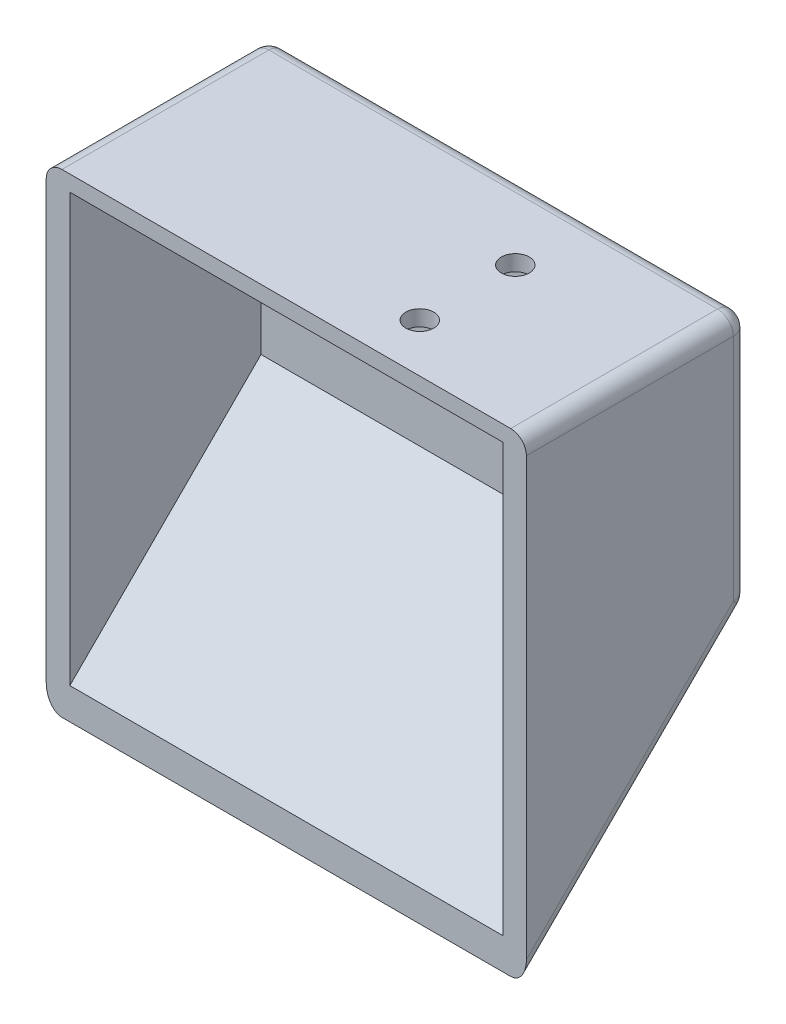
ISO-10303-21;
HEADER;
FILE_DESCRIPTION(('STEP AP214'),'2;1');
FILE_NAME('part.step','',(''),(''),'','','');
FILE_SCHEMA(('AUTOMOTIVE_DESIGN { 1 0 10303 214 1 1 1 1 }'));
ENDSEC;
DATA;
#1=APPLICATION_CONTEXT('core data for automotive mechanical design processes');
#2=APPLICATION_PROTOCOL_DEFINITION('international standard','automotive_design',2000,#1);
#3=PRODUCT_CONTEXT('',#1,'mechanical');
#4=PRODUCT('Part','Part','',(#3));
#5=PRODUCT_RELATED_PRODUCT_CATEGORY('part','',(#4));
#6=PRODUCT_DEFINITION_FORMATION('','',#4);
#7=PRODUCT_DEFINITION_CONTEXT('part definition',#1,'design');
#8=PRODUCT_DEFINITION('design','',#6,#7);
#9=PRODUCT_DEFINITION_SHAPE('','',#8);
#10=(LENGTH_UNIT() NAMED_UNIT(*) SI_UNIT(.MILLI.,.METRE.));
#11=(NAMED_UNIT(*) PLANE_ANGLE_UNIT() SI_UNIT($,.RADIAN.));
#12=(NAMED_UNIT(*) SI_UNIT($,.STERADIAN.) SOLID_ANGLE_UNIT());
#13=UNCERTAINTY_MEASURE_WITH_UNIT(LENGTH_MEASURE(1.E-05),#10,'distance_accuracy_value','');
#14=(GEOMETRIC_REPRESENTATION_CONTEXT(3) GLOBAL_UNCERTAINTY_ASSIGNED_CONTEXT((#13)) GLOBAL_UNIT_ASSIGNED_CONTEXT((#10,
#11,#12)) REPRESENTATION_CONTEXT('',''));
#15=CARTESIAN_POINT('',(0.,0.,0.));
#16=DIRECTION('',(0.,0.,1.));
#17=DIRECTION('',(1.,0.,0.));
#18=AXIS2_PLACEMENT_3D('',#15,#16,#17);
#19=CARTESIAN_POINT('',(18.1327753270791,82.564789442006,48.3517867539628));
#20=DIRECTION('',(0.,-1.,0.));
#21=DIRECTION('',(1.,0.,0.));
#22=AXIS2_PLACEMENT_3D('',#19,#20,#21);
#23=PLANE('',#22);
#24=DIRECTION('',(-1.,0.,0.));
#25=VECTOR('',#24,1.);
#26=CARTESIAN_POINT('',(18.1327753270791,82.564789442006,50.8917867539628));
#27=LINE('',#26,#25);
#28=CARTESIAN_POINT('',(54.3277753270791,82.564789442006,50.8917867539628));
#29=VERTEX_POINT('',#28);
#30=CARTESIAN_POINT('',(-18.0622246729209,82.564789442006,50.8917867539628));
#31=VERTEX_POINT('',#30);
#32=EDGE_CURVE('E55',#29,#31,#27,.T.);
#33=ORIENTED_EDGE('',*,*,#32,.T.);
#34=DIRECTION('',(0.,0.,1.));
#35=VECTOR('',#34,1.);
#36=CARTESIAN_POINT('',(-18.0622246729209,82.564789442006,48.3517867539628));
#37=LINE('',#36,#35);
#38=CARTESIAN_POINT('',(-18.0622246729209,82.564789442006,84.2728112382394));
#39=VERTEX_POINT('',#38);
#40=EDGE_CURVE('E48',#31,#39,#37,.T.);
#41=ORIENTED_EDGE('',*,*,#40,.T.);
#42=DIRECTION('',(1.,0.,0.));
#43=VECTOR('',#42,1.);
#44=CARTESIAN_POINT('',(56.8677753270791,82.564789442006,84.2728112382394));
#45=LINE('',#44,#43);
#46=CARTESIAN_POINT('',(54.3277753270791,82.564789442006,84.2728112382394));
#47=VERTEX_POINT('',#46);
#48=EDGE_CURVE('E165',#39,#47,#45,.T.);
#49=ORIENTED_EDGE('',*,*,#48,.T.);
#50=DIRECTION('',(0.,0.,-1.));
#51=VECTOR('',#50,1.);
#52=CARTESIAN_POINT('',(54.3277753270791,82.564789442006,48.3517867539628));
#53=LINE('',#52,#51);
#54=EDGE_CURVE('E11',#47,#29,#53,.T.);
#55=ORIENTED_EDGE('',*,*,#54,.T.);
#56=EDGE_LOOP('',(#33,#41,#49,#55));
#57=FACE_BOUND('',#56,.T.);
#58=CARTESIAN_POINT('',(31.8547475770863,82.564789442006,61.0517867539628));
#59=DIRECTION('',(0.,-1.,0.));
#60=DIRECTION('',(1.,0.,0.));
#61=AXIS2_PLACEMENT_3D('',#58,#59,#60);
#62=CIRCLE('',#61,2.25);
#63=CARTESIAN_POINT('',(34.1047475770863,82.564789442006,61.0517867539628));
#64=VERTEX_POINT('',#63);
#65=EDGE_CURVE('E43',#64,#64,#62,.F.);
#66=ORIENTED_EDGE('',*,*,#65,.F.);
#67=EDGE_LOOP('',(#66));
#68=FACE_BOUND('',#67,.T.);
#69=CARTESIAN_POINT('',(31.8547475770863,82.564789442006,76.4578204903704));
#70=DIRECTION('',(0.,-1.,0.));
#71=DIRECTION('',(1.,0.,0.));
#72=AXIS2_PLACEMENT_3D('',#69,#70,#71);
#73=CIRCLE('',#72,2.25);
#74=CARTESIAN_POINT('',(34.1047475770863,82.564789442006,76.4578204903704));
#75=VERTEX_POINT('',#74);
#76=EDGE_CURVE('E388',#75,#75,#73,.F.);
#77=ORIENTED_EDGE('',*,*,#76,.F.);
#78=EDGE_LOOP('',(#77));
#79=FACE_BOUND('',#78,.T.);
#80=ADVANCED_FACE('F39',(#57,#68,#79),#23,.F.);
#81=CARTESIAN_POINT('',(18.1327753270791,60.974789442006,53.4317867539628));
#82=DIRECTION('',(0.,0.,1.));
#83=DIRECTION('',(1.,0.,0.));
#84=AXIS2_PLACEMENT_3D('',#81,#82,#83);
#85=PLANE('',#84);
#86=DIRECTION('',(0.,-1.,0.));
#87=VECTOR('',#86,1.);
#88=CARTESIAN_POINT('',(-16.7922246729209,41.924789442006,53.4317867539628));
#89=LINE('',#88,#87);
#90=CARTESIAN_POINT('',(-16.7922246729209,80.024789442006,53.4317867539628));
#91=VERTEX_POINT('',#90);
#92=CARTESIAN_POINT('',(-16.7922246729209,41.924789442006,53.4317867539628));
#93=VERTEX_POINT('',#92);
#94=EDGE_CURVE('E182',#91,#93,#89,.T.);
#95=ORIENTED_EDGE('',*,*,#94,.T.);
#96=DIRECTION('',(1.,0.,0.));
#97=VECTOR('',#96,1.);
#98=CARTESIAN_POINT('',(53.0577753270791,41.924789442006,53.4317867539628));
#99=LINE('',#98,#97);
#100=CARTESIAN_POINT('',(53.0577753270791,41.924789442006,53.4317867539628));
#101=VERTEX_POINT('',#100);
#102=EDGE_CURVE('E191',#93,#101,#99,.T.);
#103=ORIENTED_EDGE('',*,*,#102,.T.);
#104=DIRECTION('',(0.,1.,0.));
#105=VECTOR('',#104,1.);
#106=CARTESIAN_POINT('',(53.0577753270791,41.924789442006,53.4317867539628));
#107=LINE('',#106,#105);
#108=CARTESIAN_POINT('',(53.0577753270791,80.024789442006,53.4317867539628));
#109=VERTEX_POINT('',#108);
#110=EDGE_CURVE('E193',#101,#109,#107,.T.);
#111=ORIENTED_EDGE('',*,*,#110,.T.);
#112=DIRECTION('',(-1.,0.,0.));
#113=VECTOR('',#112,1.);
#114=CARTESIAN_POINT('',(53.0577753270791,80.024789442006,53.4317867539628));
#115=LINE('',#114,#113);
#116=EDGE_CURVE('E159',#109,#91,#115,.T.);
#117=ORIENTED_EDGE('',*,*,#116,.T.);
#118=EDGE_LOOP('',(#95,#103,#111,#117));
#119=FACE_BOUND('',#118,.T.);
#120=ADVANCED_FACE('F339',(#119),#85,.T.);
#121=CARTESIAN_POINT('',(18.1327753270791,60.974789442006,48.3517867539628));
#122=DIRECTION('',(0.,0.,1.));
#123=DIRECTION('',(1.,0.,0.));
#124=AXIS2_PLACEMENT_3D('',#121,#122,#123);
#125=PLANE('',#124);
#126=DIRECTION('',(0.,1.,0.));
#127=VECTOR('',#126,1.);
#128=CARTESIAN_POINT('',(54.3277753270791,60.974789442006,48.3517867539628));
#129=LINE('',#128,#127);
#130=CARTESIAN_POINT('',(54.3277753270791,80.024789442006,48.3517867539628));
#131=VERTEX_POINT('',#130);
#132=CARTESIAN_POINT('',(54.3277753270791,42.9768918904337,48.3517867539628));
#133=VERTEX_POINT('',#132);
#134=EDGE_CURVE('E222',#131,#133,#129,.F.);
#135=ORIENTED_EDGE('',*,*,#134,.T.);
#136=DIRECTION('',(1.,0.,0.));
#137=VECTOR('',#136,1.);
#138=CARTESIAN_POINT('',(-20.6022246729209,42.9768918904337,48.3517867539628));
#139=LINE('',#138,#137);
#140=CARTESIAN_POINT('',(-18.0622246729209,42.9768918904337,48.3517867539628));
#141=VERTEX_POINT('',#140);
#142=EDGE_CURVE('E224',#133,#141,#139,.F.);
#143=ORIENTED_EDGE('',*,*,#142,.T.);
#144=DIRECTION('',(0.,-1.,0.));
#145=VECTOR('',#144,1.);
#146=CARTESIAN_POINT('',(-18.0622246729209,60.974789442006,48.3517867539628));
#147=LINE('',#146,#145);
#148=CARTESIAN_POINT('',(-18.0622246729209,80.024789442006,48.3517867539628));
#149=VERTEX_POINT('',#148);
#150=EDGE_CURVE('E220',#141,#149,#147,.F.);
#151=ORIENTED_EDGE('',*,*,#150,.T.);
#152=DIRECTION('',(-1.,0.,0.));
#153=VECTOR('',#152,1.);
#154=CARTESIAN_POINT('',(18.1327753270791,80.024789442006,48.3517867539628));
#155=LINE('',#154,#153);
#156=EDGE_CURVE('E218',#149,#131,#155,.F.);
#157=ORIENTED_EDGE('',*,*,#156,.T.);
#158=EDGE_LOOP('',(#135,#143,#151,#157));
#159=FACE_BOUND('',#158,.T.);
#160=ADVANCED_FACE('F300',(#159),#125,.F.);
#161=CARTESIAN_POINT('',(103.857775327079,41.924789442006,53.4317867539628));
#162=DIRECTION('',(0.,0.707106781186549,0.707106781186546));
#163=DIRECTION('',(0.,-0.707106781186546,0.707106781186549));
#164=AXIS2_PLACEMENT_3D('',#161,#162,#163);
#165=PLANE('',#164);
#166=DIRECTION('',(0.,-0.707106781186546,0.707106781186549));
#167=VECTOR('',#166,1.);
#168=CARTESIAN_POINT('',(53.0577753270791,41.924789442006,53.4317867539628));
#169=LINE('',#168,#167);
#170=CARTESIAN_POINT('',(53.0577753270791,11.0837649577295,84.2728112382394));
#171=VERTEX_POINT('',#170);
#172=EDGE_CURVE('E147',#101,#171,#169,.T.);
#173=ORIENTED_EDGE('',*,*,#172,.F.);
#174=ORIENTED_EDGE('',*,*,#102,.F.);
#175=DIRECTION('',(0.,0.707106781186546,-0.707106781186549));
#176=VECTOR('',#175,1.);
#177=CARTESIAN_POINT('',(-16.7922246729209,41.924789442006,53.4317867539628));
#178=LINE('',#177,#176);
#179=CARTESIAN_POINT('',(-16.7922246729209,11.0837649577295,84.2728112382394));
#180=VERTEX_POINT('',#179);
#181=EDGE_CURVE('E179',#180,#93,#178,.T.);
#182=ORIENTED_EDGE('',*,*,#181,.F.);
#183=DIRECTION('',(-1.,0.,0.));
#184=VECTOR('',#183,1.);
#185=CARTESIAN_POINT('',(103.857775327079,11.0837649577296,84.2728112382394));
#186=LINE('',#185,#184);
#187=EDGE_CURVE('E183',#171,#180,#186,.T.);
#188=ORIENTED_EDGE('',*,*,#187,.F.);
#189=EDGE_LOOP('',(#173,#174,#182,#188));
#190=FACE_BOUND('',#189,.T.);
#191=ADVANCED_FACE('F364',(#190),#165,.T.);
#192=CARTESIAN_POINT('',(103.857775327079,6.00376495772942,84.2728112382394));
#193=DIRECTION('',(0.,0.,1.));
#194=DIRECTION('',(1.,0.,0.));
#195=AXIS2_PLACEMENT_3D('',#192,#193,#194);
#196=PLANE('',#195);
#197=CARTESIAN_POINT('',(54.3277753270791,80.024789442006,84.2728112382394));
#198=DIRECTION('',(0.,0.,1.));
#199=DIRECTION('',(1.,0.,0.));
#200=AXIS2_PLACEMENT_3D('',#197,#198,#199);
#201=CIRCLE('',#200,2.54);
#202=CARTESIAN_POINT('',(56.8677753270791,80.024789442006,84.2728112382394));
#203=VERTEX_POINT('',#202);
#204=EDGE_CURVE('E205',#203,#47,#201,.T.);
#205=ORIENTED_EDGE('',*,*,#204,.T.);
#206=ORIENTED_EDGE('',*,*,#48,.F.);
#207=CARTESIAN_POINT('',(-18.0622246729209,80.024789442006,84.2728112382394));
#208=DIRECTION('',(0.,0.,1.));
#209=DIRECTION('',(1.,0.,0.));
#210=AXIS2_PLACEMENT_3D('',#207,#208,#209);
#211=CIRCLE('',#210,2.54);
#212=CARTESIAN_POINT('',(-20.6022246729209,80.024789442006,84.2728112382394));
#213=VERTEX_POINT('',#212);
#214=EDGE_CURVE('E203',#39,#213,#211,.T.);
#215=ORIENTED_EDGE('',*,*,#214,.T.);
#216=DIRECTION('',(0.,1.,0.));
#217=VECTOR('',#216,1.);
#218=CARTESIAN_POINT('',(-20.6022246729209,80.024789442006,84.2728112382394));
#219=LINE('',#218,#217);
#220=CARTESIAN_POINT('',(-20.6022246729209,9.59586740615707,84.2728112382394));
#221=VERTEX_POINT('',#220);
#222=EDGE_CURVE('E151',#221,#213,#219,.T.);
#223=ORIENTED_EDGE('',*,*,#222,.F.);
#224=CARTESIAN_POINT('',(-18.0622246729209,9.59586740615709,84.2728112382394));
#225=DIRECTION('',(0.,0.,1.));
#226=DIRECTION('',(0.,1.,0.));
#227=AXIS2_PLACEMENT_3D('',#224,#225,#226);
#228=ELLIPSE('',#227,3.59210244842766,2.54);
#229=CARTESIAN_POINT('',(-18.0622246729208,6.00376495772942,84.2728112382394));
#230=VERTEX_POINT('',#229);
#231=EDGE_CURVE('E210',#221,#230,#228,.T.);
#232=ORIENTED_EDGE('',*,*,#231,.T.);
#233=DIRECTION('',(-1.,0.,0.));
#234=VECTOR('',#233,1.);
#235=CARTESIAN_POINT('',(103.857775327079,6.00376495772942,84.2728112382394));
#236=LINE('',#235,#234);
#237=CARTESIAN_POINT('',(54.3277753270791,6.00376495772942,84.2728112382394));
#238=VERTEX_POINT('',#237);
#239=EDGE_CURVE('E185',#238,#230,#236,.T.);
#240=ORIENTED_EDGE('',*,*,#239,.F.);
#241=CARTESIAN_POINT('',(54.3277753270791,9.59586740615709,84.2728112382394));
#242=DIRECTION('',(0.,0.,1.));
#243=DIRECTION('',(0.,-1.,0.));
#244=AXIS2_PLACEMENT_3D('',#241,#242,#243);
#245=ELLIPSE('',#244,3.59210244842766,2.54);
#246=CARTESIAN_POINT('',(56.8677753270791,9.5958674061571,84.2728112382394));
#247=VERTEX_POINT('',#246);
#248=EDGE_CURVE('E208',#238,#247,#245,.T.);
#249=ORIENTED_EDGE('',*,*,#248,.T.);
#250=DIRECTION('',(0.,-1.,0.));
#251=VECTOR('',#250,1.);
#252=CARTESIAN_POINT('',(56.8677753270791,80.024789442006,84.2728112382394));
#253=LINE('',#252,#251);
#254=EDGE_CURVE('E160',#203,#247,#253,.T.);
#255=ORIENTED_EDGE('',*,*,#254,.F.);
#256=EDGE_LOOP('',(#205,#206,#215,#223,#232,#240,#249,#255));
#257=FACE_BOUND('',#256,.T.);
#258=DIRECTION('',(0.,1.,0.));
#259=VECTOR('',#258,1.);
#260=CARTESIAN_POINT('',(-16.7922246729209,80.024789442006,84.2728112382394));
#261=LINE('',#260,#259);
#262=CARTESIAN_POINT('',(-16.7922246729209,80.024789442006,84.2728112382394));
#263=VERTEX_POINT('',#262);
#264=EDGE_CURVE('E163',#180,#263,#261,.T.);
#265=ORIENTED_EDGE('',*,*,#264,.T.);
#266=DIRECTION('',(1.,0.,0.));
#267=VECTOR('',#266,1.);
#268=CARTESIAN_POINT('',(56.8677753270791,80.024789442006,84.2728112382394));
#269=LINE('',#268,#267);
#270=CARTESIAN_POINT('',(53.0577753270791,80.024789442006,84.2728112382394));
#271=VERTEX_POINT('',#270);
#272=EDGE_CURVE('E157',#263,#271,#269,.T.);
#273=ORIENTED_EDGE('',*,*,#272,.T.);
#274=DIRECTION('',(0.,-1.,0.));
#275=VECTOR('',#274,1.);
#276=CARTESIAN_POINT('',(53.0577753270791,80.024789442006,84.2728112382394));
#277=LINE('',#276,#275);
#278=EDGE_CURVE('E140',#271,#171,#277,.T.);
#279=ORIENTED_EDGE('',*,*,#278,.T.);
#280=ORIENTED_EDGE('',*,*,#187,.T.);
#281=EDGE_LOOP('',(#265,#273,#279,#280));
#282=FACE_BOUND('',#281,.T.);
#283=ADVANCED_FACE('F162',(#257,#282),#196,.T.);
#284=CARTESIAN_POINT('',(103.857775327079,41.924789442006,48.3517867539628));
#285=DIRECTION('',(0.,-0.707106781186547,-0.707106781186547));
#286=DIRECTION('',(0.,0.707106781186548,-0.707106781186548));
#287=AXIS2_PLACEMENT_3D('',#284,#285,#286);
#288=PLANE('',#287);
#289=ORIENTED_EDGE('',*,*,#239,.T.);
#290=DIRECTION('',(0.,-0.707106781186548,0.707106781186548));
#291=VECTOR('',#290,1.);
#292=CARTESIAN_POINT('',(-18.0622246729209,41.924789442006,48.3517867539628));
#293=LINE('',#292,#291);
#294=CARTESIAN_POINT('',(-18.0622246729209,41.1808406662199,49.095735529749));
#295=VERTEX_POINT('',#294);
#296=EDGE_CURVE('E216',#230,#295,#293,.F.);
#297=ORIENTED_EDGE('',*,*,#296,.T.);
#298=DIRECTION('',(1.,0.,0.));
#299=VECTOR('',#298,1.);
#300=CARTESIAN_POINT('',(56.8677753270791,41.1808406662199,49.095735529749));
#301=LINE('',#300,#299);
#302=CARTESIAN_POINT('',(54.3277753270791,41.1808406662199,49.095735529749));
#303=VERTEX_POINT('',#302);
#304=EDGE_CURVE('E214',#295,#303,#301,.T.);
#305=ORIENTED_EDGE('',*,*,#304,.T.);
#306=DIRECTION('',(0.,0.707106781186548,-0.707106781186548));
#307=VECTOR('',#306,1.);
#308=CARTESIAN_POINT('',(54.3277753270791,6.00376495772942,84.2728112382395));
#309=LINE('',#308,#307);
#310=EDGE_CURVE('E212',#303,#238,#309,.F.);
#311=ORIENTED_EDGE('',*,*,#310,.T.);
#312=EDGE_LOOP('',(#289,#297,#305,#311));
#313=FACE_BOUND('',#312,.T.);
#314=ADVANCED_FACE('F325',(#313),#288,.T.);
#315=CARTESIAN_POINT('',(53.0577753270791,60.974789442006,48.3517867539628));
#316=DIRECTION('',(-1.,0.,0.));
#317=DIRECTION('',(0.,0.,1.));
#318=AXIS2_PLACEMENT_3D('',#315,#316,#317);
#319=PLANE('',#318);
#320=ORIENTED_EDGE('',*,*,#110,.F.);
#321=ORIENTED_EDGE('',*,*,#172,.T.);
#322=ORIENTED_EDGE('',*,*,#278,.F.);
#323=DIRECTION('',(0.,0.,1.));
#324=VECTOR('',#323,1.);
#325=CARTESIAN_POINT('',(53.0577753270791,80.024789442006,48.3517867539628));
#326=LINE('',#325,#324);
#327=EDGE_CURVE('E144',#109,#271,#326,.T.);
#328=ORIENTED_EDGE('',*,*,#327,.F.);
#329=EDGE_LOOP('',(#320,#321,#322,#328));
#330=FACE_BOUND('',#329,.T.);
#331=ADVANCED_FACE('F143',(#330),#319,.T.);
#332=CARTESIAN_POINT('',(56.8677753270791,60.974789442006,48.3517867539628));
#333=DIRECTION('',(-1.,0.,0.));
#334=DIRECTION('',(0.,0.,1.));
#335=AXIS2_PLACEMENT_3D('',#332,#333,#334);
#336=PLANE('',#335);
#337=ORIENTED_EDGE('',*,*,#254,.T.);
#338=DIRECTION('',(0.,0.707106781186548,-0.707106781186548));
#339=VECTOR('',#338,1.);
#340=CARTESIAN_POINT('',(56.8677753270791,43.7208406662199,50.1478379781767));
#341=LINE('',#340,#339);
#342=CARTESIAN_POINT('',(56.8677753270791,42.9768918904337,50.8917867539628));
#343=VERTEX_POINT('',#342);
#344=EDGE_CURVE('E231',#247,#343,#341,.T.);
#345=ORIENTED_EDGE('',*,*,#344,.T.);
#346=DIRECTION('',(0.,1.,0.));
#347=VECTOR('',#346,1.);
#348=CARTESIAN_POINT('',(56.8677753270791,60.974789442006,50.8917867539628));
#349=LINE('',#348,#347);
#350=CARTESIAN_POINT('',(56.8677753270791,80.024789442006,50.8917867539628));
#351=VERTEX_POINT('',#350);
#352=EDGE_CURVE('E227',#343,#351,#349,.T.);
#353=ORIENTED_EDGE('',*,*,#352,.T.);
#354=DIRECTION('',(0.,0.,-1.));
#355=VECTOR('',#354,1.);
#356=CARTESIAN_POINT('',(56.8677753270791,80.024789442006,48.3517867539628));
#357=LINE('',#356,#355);
#358=EDGE_CURVE('E229',#351,#203,#357,.F.);
#359=ORIENTED_EDGE('',*,*,#358,.T.);
#360=EDGE_LOOP('',(#337,#345,#353,#359));
#361=FACE_BOUND('',#360,.T.);
#362=ADVANCED_FACE('F281',(#361),#336,.F.);
#363=CARTESIAN_POINT('',(-20.6022246729209,60.974789442006,48.3517867539628));
#364=DIRECTION('',(1.,0.,0.));
#365=DIRECTION('',(0.,0.,-1.));
#366=AXIS2_PLACEMENT_3D('',#363,#364,#365);
#367=PLANE('',#366);
#368=DIRECTION('',(0.,-1.,0.));
#369=VECTOR('',#368,1.);
#370=CARTESIAN_POINT('',(-20.6022246729209,60.974789442006,50.8917867539628));
#371=LINE('',#370,#369);
#372=CARTESIAN_POINT('',(-20.6022246729209,80.024789442006,50.8917867539628));
#373=VERTEX_POINT('',#372);
#374=CARTESIAN_POINT('',(-20.6022246729209,42.9768918904337,50.8917867539628));
#375=VERTEX_POINT('',#374);
#376=EDGE_CURVE('E198',#373,#375,#371,.T.);
#377=ORIENTED_EDGE('',*,*,#376,.T.);
#378=DIRECTION('',(0.,-0.707106781186548,0.707106781186548));
#379=VECTOR('',#378,1.);
#380=CARTESIAN_POINT('',(-20.6022246729209,7.79981618194325,86.0688624624533));
#381=LINE('',#380,#379);
#382=EDGE_CURVE('E200',#375,#221,#381,.T.);
#383=ORIENTED_EDGE('',*,*,#382,.T.);
#384=ORIENTED_EDGE('',*,*,#222,.T.);
#385=DIRECTION('',(0.,0.,1.));
#386=VECTOR('',#385,1.);
#387=CARTESIAN_POINT('',(-20.6022246729209,80.024789442006,48.3517867539628));
#388=LINE('',#387,#386);
#389=EDGE_CURVE('E196',#213,#373,#388,.F.);
#390=ORIENTED_EDGE('',*,*,#389,.T.);
#391=EDGE_LOOP('',(#377,#383,#384,#390));
#392=FACE_BOUND('',#391,.T.);
#393=ADVANCED_FACE('F317',(#392),#367,.F.);
#394=CARTESIAN_POINT('',(-16.7922246729209,60.974789442006,48.3517867539628));
#395=DIRECTION('',(1.,0.,0.));
#396=DIRECTION('',(0.,0.,-1.));
#397=AXIS2_PLACEMENT_3D('',#394,#395,#396);
#398=PLANE('',#397);
#399=ORIENTED_EDGE('',*,*,#264,.F.);
#400=ORIENTED_EDGE('',*,*,#181,.T.);
#401=ORIENTED_EDGE('',*,*,#94,.F.);
#402=DIRECTION('',(0.,0.,-1.));
#403=VECTOR('',#402,1.);
#404=CARTESIAN_POINT('',(-16.7922246729209,80.024789442006,53.4317867539628));
#405=LINE('',#404,#403);
#406=EDGE_CURVE('E175',#263,#91,#405,.T.);
#407=ORIENTED_EDGE('',*,*,#406,.F.);
#408=EDGE_LOOP('',(#399,#400,#401,#407));
#409=FACE_BOUND('',#408,.T.);
#410=ADVANCED_FACE('F353',(#409),#398,.T.);
#411=CARTESIAN_POINT('',(18.1327753270791,80.024789442006,48.3517867539628));
#412=DIRECTION('',(0.,-1.,0.));
#413=DIRECTION('',(1.,0.,0.));
#414=AXIS2_PLACEMENT_3D('',#411,#412,#413);
#415=PLANE('',#414);
#416=CARTESIAN_POINT('',(31.8547475770863,80.024789442006,61.0517867539628));
#417=DIRECTION('',(0.,-1.,0.));
#418=DIRECTION('',(1.,0.,0.));
#419=AXIS2_PLACEMENT_3D('',#416,#417,#418);
#420=CIRCLE('',#419,2.25);
#421=CARTESIAN_POINT('',(34.1047475770863,80.024789442006,61.0517867539628));
#422=VERTEX_POINT('',#421);
#423=EDGE_CURVE('E239',#422,#422,#420,.T.);
#424=ORIENTED_EDGE('',*,*,#423,.F.);
#425=EDGE_LOOP('',(#424));
#426=FACE_BOUND('',#425,.T.);
#427=CARTESIAN_POINT('',(31.8547475770863,80.024789442006,76.4578204903704));
#428=DIRECTION('',(0.,-1.,0.));
#429=DIRECTION('',(1.,0.,0.));
#430=AXIS2_PLACEMENT_3D('',#427,#428,#429);
#431=CIRCLE('',#430,2.25);
#432=CARTESIAN_POINT('',(34.1047475770863,80.024789442006,76.4578204903704));
#433=VERTEX_POINT('',#432);
#434=EDGE_CURVE('E391',#433,#433,#431,.T.);
#435=ORIENTED_EDGE('',*,*,#434,.F.);
#436=EDGE_LOOP('',(#435));
#437=FACE_BOUND('',#436,.T.);
#438=ORIENTED_EDGE('',*,*,#272,.F.);
#439=ORIENTED_EDGE('',*,*,#406,.T.);
#440=ORIENTED_EDGE('',*,*,#116,.F.);
#441=ORIENTED_EDGE('',*,*,#327,.T.);
#442=EDGE_LOOP('',(#438,#439,#440,#441));
#443=FACE_BOUND('',#442,.T.);
#444=ADVANCED_FACE('F155',(#426,#437,#443),#415,.T.);
#445=CARTESIAN_POINT('',(54.3277753270791,80.024789442006,48.3517867539628));
#446=DIRECTION('',(0.,0.,-1.));
#447=DIRECTION('',(-1.,0.,0.));
#448=AXIS2_PLACEMENT_3D('',#445,#446,#447);
#449=CYLINDRICAL_SURFACE('',#448,2.54);
#450=CARTESIAN_POINT('',(54.3277753270791,80.024789442006,50.8917867539628));
#451=DIRECTION('',(0.,0.,-1.));
#452=DIRECTION('',(-1.,0.,0.));
#453=AXIS2_PLACEMENT_3D('',#450,#451,#452);
#454=CIRCLE('',#453,2.54);
#455=EDGE_CURVE('E166',#29,#351,#454,.T.);
#456=ORIENTED_EDGE('',*,*,#455,.F.);
#457=ORIENTED_EDGE('',*,*,#54,.F.);
#458=ORIENTED_EDGE('',*,*,#204,.F.);
#459=ORIENTED_EDGE('',*,*,#358,.F.);
#460=EDGE_LOOP('',(#456,#457,#458,#459));
#461=FACE_BOUND('',#460,.T.);
#462=ADVANCED_FACE('F41',(#461),#449,.T.);
#463=CARTESIAN_POINT('',(54.3277753270791,80.024789442006,50.8917867539628));
#464=DIRECTION('',(1.,0.,0.));
#465=DIRECTION('',(0.,0.,-1.));
#466=AXIS2_PLACEMENT_3D('',#463,#464,#465);
#467=SPHERICAL_SURFACE('',#466,2.54);
#468=CARTESIAN_POINT('',(54.3277753270791,80.024789442006,50.8917867539628));
#469=DIRECTION('',(1.,0.,0.));
#470=DIRECTION('',(0.,0.,-1.));
#471=AXIS2_PLACEMENT_3D('',#468,#469,#470);
#472=CIRCLE('',#471,2.54);
#473=EDGE_CURVE('E262',#29,#131,#472,.F.);
#474=ORIENTED_EDGE('',*,*,#473,.F.);
#475=ORIENTED_EDGE('',*,*,#455,.T.);
#476=CARTESIAN_POINT('',(54.3277753270791,80.024789442006,50.8917867539628));
#477=DIRECTION('',(0.,1.,0.));
#478=DIRECTION('',(0.,0.,1.));
#479=AXIS2_PLACEMENT_3D('',#476,#477,#478);
#480=CIRCLE('',#479,2.54);
#481=EDGE_CURVE('E170',#131,#351,#480,.F.);
#482=ORIENTED_EDGE('',*,*,#481,.F.);
#483=EDGE_LOOP('',(#474,#475,#482));
#484=FACE_BOUND('',#483,.T.);
#485=ADVANCED_FACE('F275',(#484),#467,.T.);
#486=CARTESIAN_POINT('',(54.3277753270791,53.2458406662199,40.6228379781767));
#487=DIRECTION('',(0.,-0.707106781186548,0.707106781186548));
#488=DIRECTION('',(0.,-0.707106781186548,-0.707106781186548));
#489=AXIS2_PLACEMENT_3D('',#486,#487,#488);
#490=CYLINDRICAL_SURFACE('',#489,2.54);
#491=ORIENTED_EDGE('',*,*,#248,.F.);
#492=ORIENTED_EDGE('',*,*,#310,.F.);
#493=CARTESIAN_POINT('',(54.3277753270791,42.9768918904337,50.8917867539628));
#494=DIRECTION('',(0.,0.707106781186548,-0.707106781186548));
#495=DIRECTION('',(0.,0.707106781186548,0.707106781186548));
#496=AXIS2_PLACEMENT_3D('',#493,#494,#495);
#497=CIRCLE('',#496,2.54);
#498=EDGE_CURVE('E259',#343,#303,#497,.T.);
#499=ORIENTED_EDGE('',*,*,#498,.F.);
#500=ORIENTED_EDGE('',*,*,#344,.F.);
#501=EDGE_LOOP('',(#491,#492,#499,#500));
#502=FACE_BOUND('',#501,.T.);
#503=ADVANCED_FACE('F289',(#502),#490,.T.);
#504=CARTESIAN_POINT('',(54.3277753270791,60.974789442006,50.8917867539628));
#505=DIRECTION('',(0.,1.,0.));
#506=DIRECTION('',(0.,0.,1.));
#507=AXIS2_PLACEMENT_3D('',#504,#505,#506);
#508=CYLINDRICAL_SURFACE('',#507,2.54);
#509=ORIENTED_EDGE('',*,*,#481,.T.);
#510=ORIENTED_EDGE('',*,*,#352,.F.);
#511=CARTESIAN_POINT('',(54.3277753270791,42.9768918904337,50.8917867539628));
#512=DIRECTION('',(0.,-1.,0.));
#513=DIRECTION('',(0.,0.,-1.));
#514=AXIS2_PLACEMENT_3D('',#511,#512,#513);
#515=CIRCLE('',#514,2.54);
#516=EDGE_CURVE('E256',#133,#343,#515,.T.);
#517=ORIENTED_EDGE('',*,*,#516,.F.);
#518=ORIENTED_EDGE('',*,*,#134,.F.);
#519=EDGE_LOOP('',(#509,#510,#517,#518));
#520=FACE_BOUND('',#519,.T.);
#521=ADVANCED_FACE('F270',(#520),#508,.T.);
#522=CARTESIAN_POINT('',(18.1327753270791,80.024789442006,50.8917867539628));
#523=DIRECTION('',(-1.,0.,0.));
#524=DIRECTION('',(0.,-1.,0.));
#525=AXIS2_PLACEMENT_3D('',#522,#523,#524);
#526=CYLINDRICAL_SURFACE('',#525,2.54);
#527=ORIENTED_EDGE('',*,*,#473,.T.);
#528=ORIENTED_EDGE('',*,*,#156,.F.);
#529=CARTESIAN_POINT('',(-18.0622246729209,80.024789442006,50.8917867539628));
#530=DIRECTION('',(-1.,0.,0.));
#531=DIRECTION('',(0.,0.,1.));
#532=AXIS2_PLACEMENT_3D('',#529,#530,#531);
#533=CIRCLE('',#532,2.54);
#534=EDGE_CURVE('E253',#31,#149,#533,.T.);
#535=ORIENTED_EDGE('',*,*,#534,.F.);
#536=ORIENTED_EDGE('',*,*,#32,.F.);
#537=EDGE_LOOP('',(#527,#528,#535,#536));
#538=FACE_BOUND('',#537,.T.);
#539=ADVANCED_FACE('F304',(#538),#526,.T.);
#540=CARTESIAN_POINT('',(-18.0622246729209,80.024789442006,48.3517867539628));
#541=DIRECTION('',(0.,0.,1.));
#542=DIRECTION('',(1.,0.,0.));
#543=AXIS2_PLACEMENT_3D('',#540,#541,#542);
#544=CYLINDRICAL_SURFACE('',#543,2.54);
#545=ORIENTED_EDGE('',*,*,#214,.F.);
#546=ORIENTED_EDGE('',*,*,#40,.F.);
#547=CARTESIAN_POINT('',(-18.0622246729209,80.024789442006,50.8917867539628));
#548=DIRECTION('',(0.,0.,-1.));
#549=DIRECTION('',(-1.,0.,0.));
#550=AXIS2_PLACEMENT_3D('',#547,#548,#549);
#551=CIRCLE('',#550,2.54);
#552=EDGE_CURVE('E250',#373,#31,#551,.T.);
#553=ORIENTED_EDGE('',*,*,#552,.F.);
#554=ORIENTED_EDGE('',*,*,#389,.F.);
#555=EDGE_LOOP('',(#545,#546,#553,#554));
#556=FACE_BOUND('',#555,.T.);
#557=ADVANCED_FACE('F313',(#556),#544,.T.);
#558=CARTESIAN_POINT('',(54.3277753270791,42.9768918904337,50.8917867539628));
#559=DIRECTION('',(1.,0.,0.));
#560=DIRECTION('',(0.,0.,-1.));
#561=AXIS2_PLACEMENT_3D('',#558,#559,#560);
#562=SPHERICAL_SURFACE('',#561,2.54);
#563=ORIENTED_EDGE('',*,*,#516,.T.);
#564=ORIENTED_EDGE('',*,*,#498,.T.);
#565=CARTESIAN_POINT('',(54.3277753270791,42.9768918904337,50.8917867539628));
#566=DIRECTION('',(1.,0.,0.));
#567=DIRECTION('',(0.,0.,-1.));
#568=AXIS2_PLACEMENT_3D('',#565,#566,#567);
#569=CIRCLE('',#568,2.54);
#570=EDGE_CURVE('E247',#133,#303,#569,.F.);
#571=ORIENTED_EDGE('',*,*,#570,.F.);
#572=EDGE_LOOP('',(#563,#564,#571));
#573=FACE_BOUND('',#572,.T.);
#574=ADVANCED_FACE('F292',(#573),#562,.T.);
#575=CARTESIAN_POINT('',(-18.0622246729209,80.024789442006,50.8917867539628));
#576=DIRECTION('',(0.,1.,0.));
#577=DIRECTION('',(0.,0.,1.));
#578=AXIS2_PLACEMENT_3D('',#575,#576,#577);
#579=SPHERICAL_SURFACE('',#578,2.54);
#580=ORIENTED_EDGE('',*,*,#552,.T.);
#581=ORIENTED_EDGE('',*,*,#534,.T.);
#582=CARTESIAN_POINT('',(-18.0622246729209,80.024789442006,50.8917867539628));
#583=DIRECTION('',(0.,1.,0.));
#584=DIRECTION('',(0.,0.,1.));
#585=AXIS2_PLACEMENT_3D('',#582,#583,#584);
#586=CIRCLE('',#585,2.54);
#587=EDGE_CURVE('E244',#373,#149,#586,.F.);
#588=ORIENTED_EDGE('',*,*,#587,.F.);
#589=EDGE_LOOP('',(#580,#581,#588));
#590=FACE_BOUND('',#589,.T.);
#591=ADVANCED_FACE('F308',(#590),#579,.T.);
#592=CARTESIAN_POINT('',(103.857775327079,42.9768918904337,50.8917867539628));
#593=DIRECTION('',(-1.,0.,0.));
#594=DIRECTION('',(0.,0.,1.));
#595=AXIS2_PLACEMENT_3D('',#592,#593,#594);
#596=CYLINDRICAL_SURFACE('',#595,2.54);
#597=ORIENTED_EDGE('',*,*,#570,.T.);
#598=ORIENTED_EDGE('',*,*,#304,.F.);
#599=CARTESIAN_POINT('',(-18.0622246729209,42.9768918904337,50.8917867539628));
#600=DIRECTION('',(-1.,0.,0.));
#601=DIRECTION('',(0.,0.,1.));
#602=AXIS2_PLACEMENT_3D('',#599,#600,#601);
#603=CIRCLE('',#602,2.54);
#604=EDGE_CURVE('E241',#141,#295,#603,.T.);
#605=ORIENTED_EDGE('',*,*,#604,.F.);
#606=ORIENTED_EDGE('',*,*,#142,.F.);
#607=EDGE_LOOP('',(#597,#598,#605,#606));
#608=FACE_BOUND('',#607,.T.);
#609=ADVANCED_FACE('F297',(#608),#596,.T.);
#610=CARTESIAN_POINT('',(-18.0622246729209,60.974789442006,50.8917867539628));
#611=DIRECTION('',(0.,-1.,0.));
#612=DIRECTION('',(0.,0.,-1.));
#613=AXIS2_PLACEMENT_3D('',#610,#611,#612);
#614=CYLINDRICAL_SURFACE('',#613,2.54);
#615=ORIENTED_EDGE('',*,*,#587,.T.);
#616=ORIENTED_EDGE('',*,*,#150,.F.);
#617=CARTESIAN_POINT('',(-18.0622246729209,42.9768918904337,50.8917867539628));
#618=DIRECTION('',(0.,-1.,0.));
#619=DIRECTION('',(0.,0.,-1.));
#620=AXIS2_PLACEMENT_3D('',#617,#618,#619);
#621=CIRCLE('',#620,2.54);
#622=EDGE_CURVE('E238',#375,#141,#621,.T.);
#623=ORIENTED_EDGE('',*,*,#622,.F.);
#624=ORIENTED_EDGE('',*,*,#376,.F.);
#625=EDGE_LOOP('',(#615,#616,#623,#624));
#626=FACE_BOUND('',#625,.T.);
#627=ADVANCED_FACE('F329',(#626),#614,.T.);
#628=CARTESIAN_POINT('',(-18.0622246729209,42.9768918904337,50.8917867539628));
#629=DIRECTION('',(-1.,0.,0.));
#630=DIRECTION('',(0.,0.,1.));
#631=AXIS2_PLACEMENT_3D('',#628,#629,#630);
#632=SPHERICAL_SURFACE('',#631,2.54);
#633=ORIENTED_EDGE('',*,*,#622,.T.);
#634=ORIENTED_EDGE('',*,*,#604,.T.);
#635=CARTESIAN_POINT('',(-18.0622246729209,42.9768918904337,50.8917867539628));
#636=DIRECTION('',(0.,0.707106781186547,-0.707106781186548));
#637=DIRECTION('',(0.,0.707106781186548,0.707106781186547));
#638=AXIS2_PLACEMENT_3D('',#635,#636,#637);
#639=CIRCLE('',#638,2.54);
#640=EDGE_CURVE('E235',#375,#295,#639,.F.);
#641=ORIENTED_EDGE('',*,*,#640,.F.);
#642=EDGE_LOOP('',(#633,#634,#641));
#643=FACE_BOUND('',#642,.T.);
#644=ADVANCED_FACE('F327',(#643),#632,.T.);
#645=CARTESIAN_POINT('',(-18.0622246729209,53.2458406662199,40.6228379781767));
#646=DIRECTION('',(0.,0.707106781186548,-0.707106781186548));
#647=DIRECTION('',(0.,0.707106781186548,0.707106781186548));
#648=AXIS2_PLACEMENT_3D('',#645,#646,#647);
#649=CYLINDRICAL_SURFACE('',#648,2.54);
#650=ORIENTED_EDGE('',*,*,#640,.T.);
#651=ORIENTED_EDGE('',*,*,#296,.F.);
#652=ORIENTED_EDGE('',*,*,#231,.F.);
#653=ORIENTED_EDGE('',*,*,#382,.F.);
#654=EDGE_LOOP('',(#650,#651,#652,#653));
#655=FACE_BOUND('',#654,.T.);
#656=ADVANCED_FACE('F321',(#655),#649,.T.);
#657=CARTESIAN_POINT('',(31.8547475770863,60.974789442006,76.4578204903704));
#658=DIRECTION('',(0.,1.,0.));
#659=DIRECTION('',(-1.,0.,0.));
#660=AXIS2_PLACEMENT_3D('',#657,#658,#659);
#661=CYLINDRICAL_SURFACE('',#660,2.25);
#662=ORIENTED_EDGE('',*,*,#76,.T.);
#663=EDGE_LOOP('',(#662));
#664=FACE_BOUND('',#663,.T.);
#665=ORIENTED_EDGE('',*,*,#434,.T.);
#666=EDGE_LOOP('',(#665));
#667=FACE_BOUND('',#666,.T.);
#668=ADVANCED_FACE('F349',(#664,#667),#661,.F.);
#669=CARTESIAN_POINT('',(31.8547475770863,60.974789442006,61.0517867539628));
#670=DIRECTION('',(0.,1.,0.));
#671=DIRECTION('',(-1.,0.,0.));
#672=AXIS2_PLACEMENT_3D('',#669,#670,#671);
#673=CYLINDRICAL_SURFACE('',#672,2.25);
#674=ORIENTED_EDGE('',*,*,#65,.T.);
#675=EDGE_LOOP('',(#674));
#676=FACE_BOUND('',#675,.T.);
#677=ORIENTED_EDGE('',*,*,#423,.T.);
#678=EDGE_LOOP('',(#677));
#679=FACE_BOUND('',#678,.T.);
#680=ADVANCED_FACE('F379',(#676,#679),#673,.F.);
#681=CLOSED_SHELL('',(#80,#120,#160,#191,#283,#314,#331,#362,#393,#410,#444,#462,#485,#503,#521,
#539,#557,#574,#591,#609,#627,#644,#656,#668,#680));
#682=MANIFOLD_SOLID_BREP('B2',#681);
#683=ADVANCED_BREP_SHAPE_REPRESENTATION('',(#18,#682),#14);
#684=SHAPE_DEFINITION_REPRESENTATION(#9,#683);
ENDSEC;
END-ISO-10303-21;
